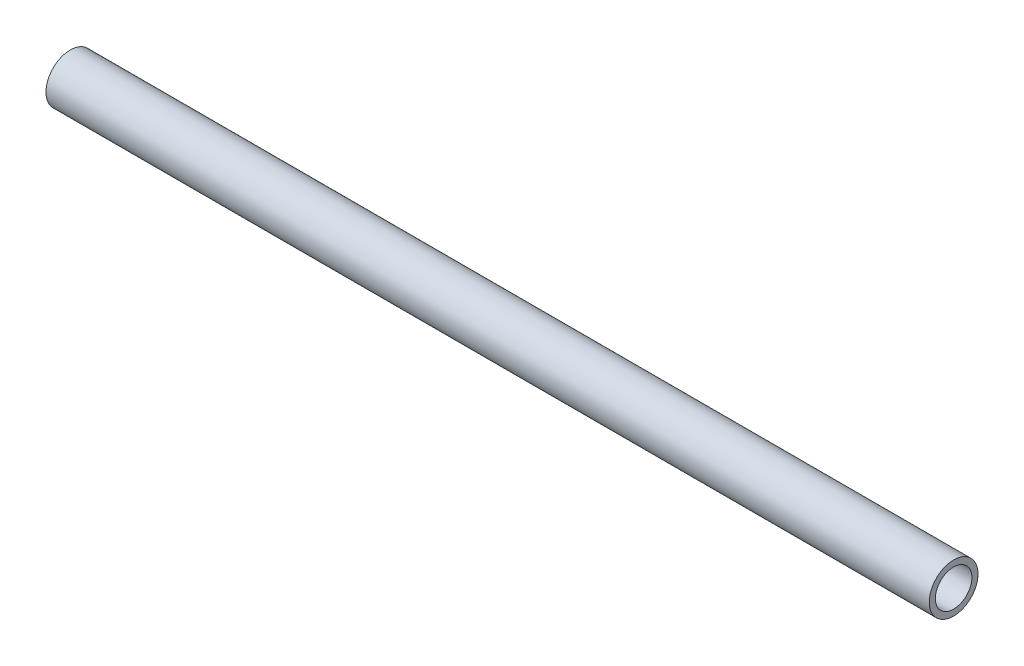
ISO-10303-21;
HEADER;
FILE_DESCRIPTION(('STEP AP214'),'2;1');
FILE_NAME('part.step','',(''),(''),'','','');
FILE_SCHEMA(('AUTOMOTIVE_DESIGN { 1 0 10303 214 1 1 1 1 }'));
ENDSEC;
DATA;
#1=APPLICATION_CONTEXT('core data for automotive mechanical design processes');
#2=APPLICATION_PROTOCOL_DEFINITION('international standard','automotive_design',2000,#1);
#3=PRODUCT_CONTEXT('',#1,'mechanical');
#4=PRODUCT('Part','Part','',(#3));
#5=PRODUCT_RELATED_PRODUCT_CATEGORY('part','',(#4));
#6=PRODUCT_DEFINITION_FORMATION('','',#4);
#7=PRODUCT_DEFINITION_CONTEXT('part definition',#1,'design');
#8=PRODUCT_DEFINITION('design','',#6,#7);
#9=PRODUCT_DEFINITION_SHAPE('','',#8);
#10=(LENGTH_UNIT() NAMED_UNIT(*) SI_UNIT(.MILLI.,.METRE.));
#11=(NAMED_UNIT(*) PLANE_ANGLE_UNIT() SI_UNIT($,.RADIAN.));
#12=(NAMED_UNIT(*) SI_UNIT($,.STERADIAN.) SOLID_ANGLE_UNIT());
#13=UNCERTAINTY_MEASURE_WITH_UNIT(LENGTH_MEASURE(1.E-05),#10,'distance_accuracy_value','');
#14=(GEOMETRIC_REPRESENTATION_CONTEXT(3) GLOBAL_UNCERTAINTY_ASSIGNED_CONTEXT((#13)) GLOBAL_UNIT_ASSIGNED_CONTEXT((#10,
#11,#12)) REPRESENTATION_CONTEXT('',''));
#15=CARTESIAN_POINT('',(0.,0.,0.));
#16=DIRECTION('',(0.,0.,1.));
#17=DIRECTION('',(1.,0.,0.));
#18=AXIS2_PLACEMENT_3D('',#15,#16,#17);
#19=CARTESIAN_POINT('',(145.,0.,0.));
#20=DIRECTION('',(1.,0.,0.));
#21=DIRECTION('',(0.,0.,-1.));
#22=AXIS2_PLACEMENT_3D('',#19,#20,#21);
#23=PLANE('',#22);
#24=CARTESIAN_POINT('',(145.,0.,0.));
#25=DIRECTION('',(1.,0.,0.));
#26=DIRECTION('',(0.,0.,-1.));
#27=AXIS2_PLACEMENT_3D('',#24,#25,#26);
#28=CIRCLE('',#27,8.);
#29=CARTESIAN_POINT('',(145.,0.,-8.));
#30=VERTEX_POINT('',#29);
#31=EDGE_CURVE('E10',#30,#30,#28,.T.);
#32=ORIENTED_EDGE('',*,*,#31,.T.);
#33=EDGE_LOOP('',(#32));
#34=FACE_BOUND('',#33,.T.);
#35=CARTESIAN_POINT('',(145.,0.,0.));
#36=DIRECTION('',(1.,0.,0.));
#37=DIRECTION('',(0.,0.,-1.));
#38=AXIS2_PLACEMENT_3D('',#35,#36,#37);
#39=CIRCLE('',#38,6.);
#40=CARTESIAN_POINT('',(145.,0.,-6.));
#41=VERTEX_POINT('',#40);
#42=EDGE_CURVE('E48',#41,#41,#39,.T.);
#43=ORIENTED_EDGE('',*,*,#42,.F.);
#44=EDGE_LOOP('',(#43));
#45=FACE_BOUND('',#44,.T.);
#46=ADVANCED_FACE('F37',(#34,#45),#23,.T.);
#47=CARTESIAN_POINT('',(-145.,0.,0.));
#48=DIRECTION('',(1.,0.,0.));
#49=DIRECTION('',(0.,0.,-1.));
#50=AXIS2_PLACEMENT_3D('',#47,#48,#49);
#51=PLANE('',#50);
#52=CARTESIAN_POINT('',(-145.,0.,0.));
#53=DIRECTION('',(1.,0.,0.));
#54=DIRECTION('',(0.,0.,-1.));
#55=AXIS2_PLACEMENT_3D('',#52,#53,#54);
#56=CIRCLE('',#55,8.);
#57=CARTESIAN_POINT('',(-145.,0.,-8.));
#58=VERTEX_POINT('',#57);
#59=EDGE_CURVE('E41',#58,#58,#56,.T.);
#60=ORIENTED_EDGE('',*,*,#59,.F.);
#61=EDGE_LOOP('',(#60));
#62=FACE_BOUND('',#61,.T.);
#63=CARTESIAN_POINT('',(-145.,0.,0.));
#64=DIRECTION('',(1.,0.,0.));
#65=DIRECTION('',(0.,0.,-1.));
#66=AXIS2_PLACEMENT_3D('',#63,#64,#65);
#67=CIRCLE('',#66,6.);
#68=CARTESIAN_POINT('',(-145.,0.,-6.));
#69=VERTEX_POINT('',#68);
#70=EDGE_CURVE('E50',#69,#69,#67,.T.);
#71=ORIENTED_EDGE('',*,*,#70,.T.);
#72=EDGE_LOOP('',(#71));
#73=FACE_BOUND('',#72,.T.);
#74=ADVANCED_FACE('F60',(#62,#73),#51,.F.);
#75=CARTESIAN_POINT('',(145.,0.,0.));
#76=DIRECTION('',(-1.,0.,0.));
#77=DIRECTION('',(0.,0.,1.));
#78=AXIS2_PLACEMENT_3D('',#75,#76,#77);
#79=CYLINDRICAL_SURFACE('',#78,8.);
#80=ORIENTED_EDGE('',*,*,#31,.F.);
#81=EDGE_LOOP('',(#80));
#82=FACE_BOUND('',#81,.T.);
#83=ORIENTED_EDGE('',*,*,#59,.T.);
#84=EDGE_LOOP('',(#83));
#85=FACE_BOUND('',#84,.T.);
#86=ADVANCED_FACE('F39',(#82,#85),#79,.T.);
#87=CARTESIAN_POINT('',(145.,0.,0.));
#88=DIRECTION('',(-1.,0.,0.));
#89=DIRECTION('',(0.,0.,1.));
#90=AXIS2_PLACEMENT_3D('',#87,#88,#89);
#91=CYLINDRICAL_SURFACE('',#90,6.);
#92=ORIENTED_EDGE('',*,*,#42,.T.);
#93=EDGE_LOOP('',(#92));
#94=FACE_BOUND('',#93,.T.);
#95=ORIENTED_EDGE('',*,*,#70,.F.);
#96=EDGE_LOOP('',(#95));
#97=FACE_BOUND('',#96,.T.);
#98=ADVANCED_FACE('F56',(#94,#97),#91,.F.);
#99=CLOSED_SHELL('',(#46,#74,#86,#98));
#100=MANIFOLD_SOLID_BREP('B2',#99);
#101=ADVANCED_BREP_SHAPE_REPRESENTATION('',(#18,#100),#14);
#102=SHAPE_DEFINITION_REPRESENTATION(#9,#101);
ENDSEC;
END-ISO-10303-21;
